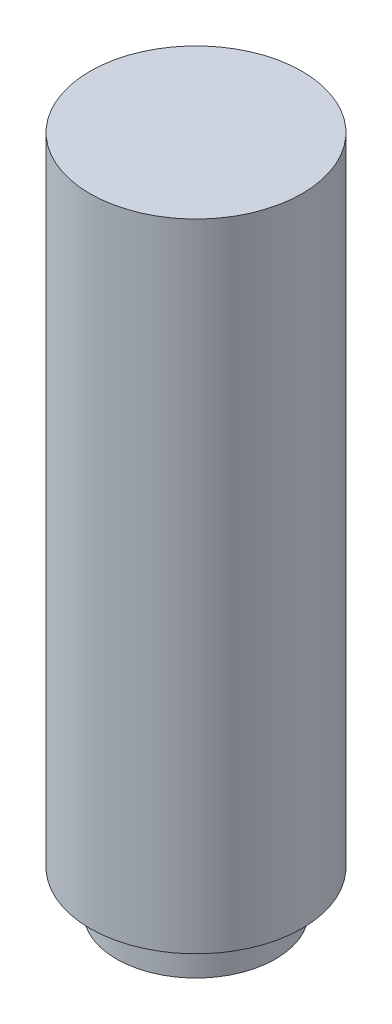
ISO-10303-21;
HEADER;
FILE_DESCRIPTION(('STEP AP214'),'2;1');
FILE_NAME('part.step','',(''),(''),'','','');
FILE_SCHEMA(('AUTOMOTIVE_DESIGN { 1 0 10303 214 1 1 1 1 }'));
ENDSEC;
DATA;
#1=APPLICATION_CONTEXT('core data for automotive mechanical design processes');
#2=APPLICATION_PROTOCOL_DEFINITION('international standard','automotive_design',2000,#1);
#3=PRODUCT_CONTEXT('',#1,'mechanical');
#4=PRODUCT('Part','Part','',(#3));
#5=PRODUCT_RELATED_PRODUCT_CATEGORY('part','',(#4));
#6=PRODUCT_DEFINITION_FORMATION('','',#4);
#7=PRODUCT_DEFINITION_CONTEXT('part definition',#1,'design');
#8=PRODUCT_DEFINITION('design','',#6,#7);
#9=PRODUCT_DEFINITION_SHAPE('','',#8);
#10=(LENGTH_UNIT() NAMED_UNIT(*) SI_UNIT(.MILLI.,.METRE.));
#11=(NAMED_UNIT(*) PLANE_ANGLE_UNIT() SI_UNIT($,.RADIAN.));
#12=(NAMED_UNIT(*) SI_UNIT($,.STERADIAN.) SOLID_ANGLE_UNIT());
#13=UNCERTAINTY_MEASURE_WITH_UNIT(LENGTH_MEASURE(1.E-05),#10,'distance_accuracy_value','');
#14=(GEOMETRIC_REPRESENTATION_CONTEXT(3) GLOBAL_UNCERTAINTY_ASSIGNED_CONTEXT((#13)) GLOBAL_UNIT_ASSIGNED_CONTEXT((#10,
#11,#12)) REPRESENTATION_CONTEXT('',''));
#15=CARTESIAN_POINT('',(0.,0.,0.));
#16=DIRECTION('',(0.,0.,1.));
#17=DIRECTION('',(1.,0.,0.));
#18=AXIS2_PLACEMENT_3D('',#15,#16,#17);
#19=CARTESIAN_POINT('',(0.,240.,0.));
#20=DIRECTION('',(0.,-1.,0.));
#21=DIRECTION('',(0.,0.,-1.));
#22=AXIS2_PLACEMENT_3D('',#19,#20,#21);
#23=CYLINDRICAL_SURFACE('',#22,40.);
#24=CARTESIAN_POINT('',(0.,240.,0.));
#25=DIRECTION('',(0.,1.,0.));
#26=DIRECTION('',(0.,0.,1.));
#27=AXIS2_PLACEMENT_3D('',#24,#25,#26);
#28=CIRCLE('',#27,40.);
#29=CARTESIAN_POINT('',(0.,240.,40.));
#30=VERTEX_POINT('',#29);
#31=EDGE_CURVE('E47',#30,#30,#28,.T.);
#32=ORIENTED_EDGE('',*,*,#31,.F.);
#33=EDGE_LOOP('',(#32));
#34=FACE_BOUND('',#33,.T.);
#35=CARTESIAN_POINT('',(0.,0.,0.));
#36=DIRECTION('',(0.,1.,0.));
#37=DIRECTION('',(0.,0.,1.));
#38=AXIS2_PLACEMENT_3D('',#35,#36,#37);
#39=CIRCLE('',#38,40.);
#40=CARTESIAN_POINT('',(0.,0.,40.));
#41=VERTEX_POINT('',#40);
#42=EDGE_CURVE('E42',#41,#41,#39,.T.);
#43=ORIENTED_EDGE('',*,*,#42,.T.);
#44=EDGE_LOOP('',(#43));
#45=FACE_BOUND('',#44,.T.);
#46=ADVANCED_FACE('F39',(#34,#45),#23,.T.);
#47=CARTESIAN_POINT('',(0.,240.,0.));
#48=DIRECTION('',(0.,1.,0.));
#49=DIRECTION('',(0.,0.,1.));
#50=AXIS2_PLACEMENT_3D('',#47,#48,#49);
#51=PLANE('',#50);
#52=ORIENTED_EDGE('',*,*,#31,.T.);
#53=EDGE_LOOP('',(#52));
#54=FACE_BOUND('',#53,.T.);
#55=ADVANCED_FACE('F88',(#54),#51,.T.);
#56=CARTESIAN_POINT('',(0.,0.,0.));
#57=DIRECTION('',(0.,1.,0.));
#58=DIRECTION('',(0.,0.,1.));
#59=AXIS2_PLACEMENT_3D('',#56,#57,#58);
#60=PLANE('',#59);
#61=CARTESIAN_POINT('',(0.,0.,0.));
#62=DIRECTION('',(0.,-1.,0.));
#63=DIRECTION('',(0.,0.,-1.));
#64=AXIS2_PLACEMENT_3D('',#61,#62,#63);
#65=CIRCLE('',#64,30.);
#66=CARTESIAN_POINT('',(0.,0.,-30.));
#67=VERTEX_POINT('',#66);
#68=EDGE_CURVE('E10',#67,#67,#65,.T.);
#69=ORIENTED_EDGE('',*,*,#68,.F.);
#70=EDGE_LOOP('',(#69));
#71=FACE_BOUND('',#70,.T.);
#72=ORIENTED_EDGE('',*,*,#42,.F.);
#73=EDGE_LOOP('',(#72));
#74=FACE_BOUND('',#73,.T.);
#75=ADVANCED_FACE('F83',(#71,#74),#60,.F.);
#76=CARTESIAN_POINT('',(0.,-15.,0.));
#77=DIRECTION('',(0.,1.,0.));
#78=DIRECTION('',(0.,0.,1.));
#79=AXIS2_PLACEMENT_3D('',#76,#77,#78);
#80=CYLINDRICAL_SURFACE('',#79,30.);
#81=CARTESIAN_POINT('',(0.,-15.,0.));
#82=DIRECTION('',(0.,-1.,0.));
#83=DIRECTION('',(0.,0.,-1.));
#84=AXIS2_PLACEMENT_3D('',#81,#82,#83);
#85=CIRCLE('',#84,30.);
#86=CARTESIAN_POINT('',(0.,-15.,-30.));
#87=VERTEX_POINT('',#86);
#88=EDGE_CURVE('E54',#87,#87,#85,.T.);
#89=ORIENTED_EDGE('',*,*,#88,.F.);
#90=EDGE_LOOP('',(#89));
#91=FACE_BOUND('',#90,.T.);
#92=ORIENTED_EDGE('',*,*,#68,.T.);
#93=EDGE_LOOP('',(#92));
#94=FACE_BOUND('',#93,.T.);
#95=ADVANCED_FACE('F78',(#91,#94),#80,.T.);
#96=CARTESIAN_POINT('',(0.,-15.,0.));
#97=DIRECTION('',(0.,-1.,0.));
#98=DIRECTION('',(0.,0.,-1.));
#99=AXIS2_PLACEMENT_3D('',#96,#97,#98);
#100=PLANE('',#99);
#101=CARTESIAN_POINT('',(0.,-15.,0.));
#102=DIRECTION('',(0.,-1.,0.));
#103=DIRECTION('',(0.,0.,-1.));
#104=AXIS2_PLACEMENT_3D('',#101,#102,#103);
#105=CIRCLE('',#104,12.5);
#106=CARTESIAN_POINT('',(0.,-15.,-12.5));
#107=VERTEX_POINT('',#106);
#108=EDGE_CURVE('E59',#107,#107,#105,.T.);
#109=ORIENTED_EDGE('',*,*,#108,.F.);
#110=EDGE_LOOP('',(#109));
#111=FACE_BOUND('',#110,.T.);
#112=ORIENTED_EDGE('',*,*,#88,.T.);
#113=EDGE_LOOP('',(#112));
#114=FACE_BOUND('',#113,.T.);
#115=ADVANCED_FACE('F72',(#111,#114),#100,.T.);
#116=CARTESIAN_POINT('',(0.,-5.,0.));
#117=DIRECTION('',(0.,-1.,0.));
#118=DIRECTION('',(0.,0.,-1.));
#119=AXIS2_PLACEMENT_3D('',#116,#117,#118);
#120=CYLINDRICAL_SURFACE('',#119,12.5);
#121=CARTESIAN_POINT('',(0.,-5.,0.));
#122=DIRECTION('',(0.,-1.,0.));
#123=DIRECTION('',(0.,0.,-1.));
#124=AXIS2_PLACEMENT_3D('',#121,#122,#123);
#125=CIRCLE('',#124,12.5);
#126=CARTESIAN_POINT('',(0.,-5.,-12.5));
#127=VERTEX_POINT('',#126);
#128=EDGE_CURVE('E58',#127,#127,#125,.T.);
#129=ORIENTED_EDGE('',*,*,#128,.F.);
#130=EDGE_LOOP('',(#129));
#131=FACE_BOUND('',#130,.T.);
#132=ORIENTED_EDGE('',*,*,#108,.T.);
#133=EDGE_LOOP('',(#132));
#134=FACE_BOUND('',#133,.T.);
#135=ADVANCED_FACE('F69',(#131,#134),#120,.F.);
#136=CARTESIAN_POINT('',(0.,-5.,0.));
#137=DIRECTION('',(0.,-1.,0.));
#138=DIRECTION('',(0.,0.,-1.));
#139=AXIS2_PLACEMENT_3D('',#136,#137,#138);
#140=PLANE('',#139);
#141=ORIENTED_EDGE('',*,*,#128,.T.);
#142=EDGE_LOOP('',(#141));
#143=FACE_BOUND('',#142,.T.);
#144=ADVANCED_FACE('F67',(#143),#140,.T.);
#145=CLOSED_SHELL('',(#46,#55,#75,#95,#115,#135,#144));
#146=MANIFOLD_SOLID_BREP('B2',#145);
#147=ADVANCED_BREP_SHAPE_REPRESENTATION('',(#18,#146),#14);
#148=SHAPE_DEFINITION_REPRESENTATION(#9,#147);
ENDSEC;
END-ISO-10303-21;
